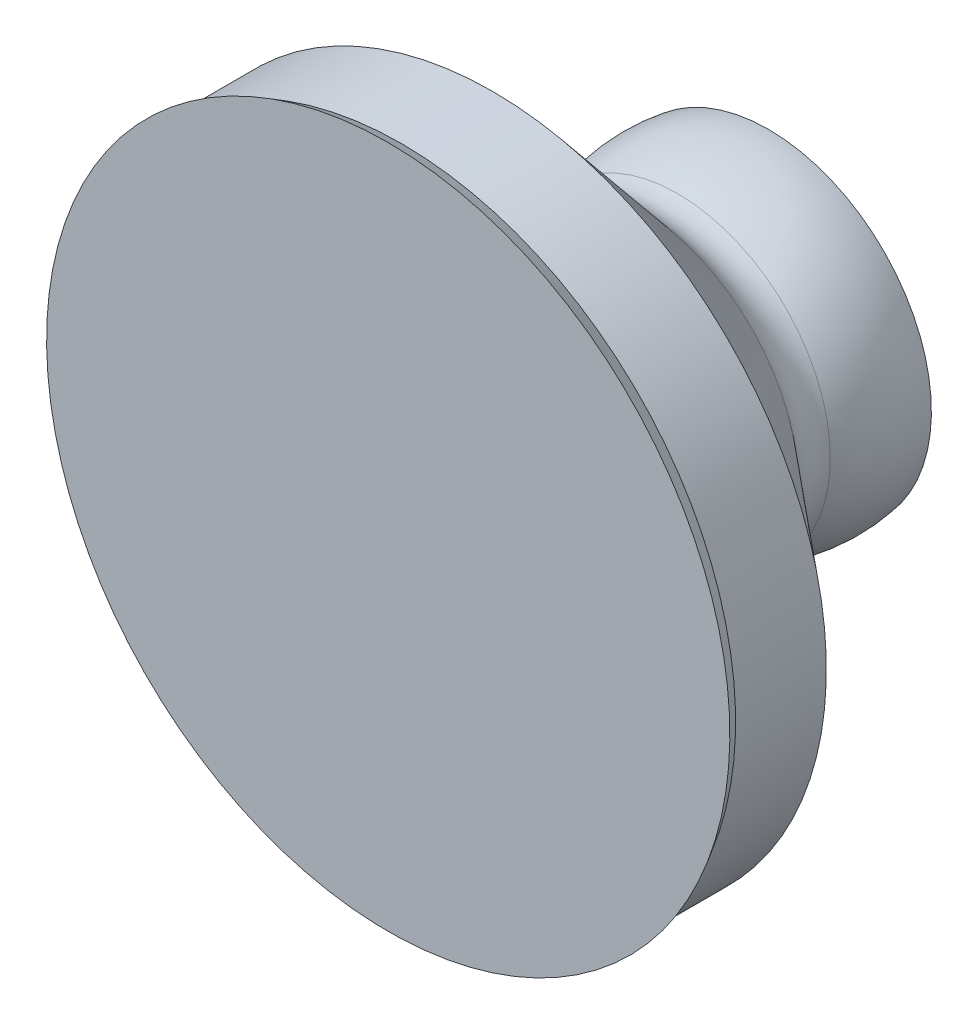
ISO-10303-21;
HEADER;
FILE_DESCRIPTION(('STEP AP214'),'2;1');
FILE_NAME('part.step','',(''),(''),'','','');
FILE_SCHEMA(('AUTOMOTIVE_DESIGN { 1 0 10303 214 1 1 1 1 }'));
ENDSEC;
DATA;
#1=APPLICATION_CONTEXT('core data for automotive mechanical design processes');
#2=APPLICATION_PROTOCOL_DEFINITION('international standard','automotive_design',2000,#1);
#3=PRODUCT_CONTEXT('',#1,'mechanical');
#4=PRODUCT('Part','Part','',(#3));
#5=PRODUCT_RELATED_PRODUCT_CATEGORY('part','',(#4));
#6=PRODUCT_DEFINITION_FORMATION('','',#4);
#7=PRODUCT_DEFINITION_CONTEXT('part definition',#1,'design');
#8=PRODUCT_DEFINITION('design','',#6,#7);
#9=PRODUCT_DEFINITION_SHAPE('','',#8);
#10=(LENGTH_UNIT() NAMED_UNIT(*) SI_UNIT(.MILLI.,.METRE.));
#11=(NAMED_UNIT(*) PLANE_ANGLE_UNIT() SI_UNIT($,.RADIAN.));
#12=(NAMED_UNIT(*) SI_UNIT($,.STERADIAN.) SOLID_ANGLE_UNIT());
#13=UNCERTAINTY_MEASURE_WITH_UNIT(LENGTH_MEASURE(1.E-05),#10,'distance_accuracy_value','');
#14=(GEOMETRIC_REPRESENTATION_CONTEXT(3) GLOBAL_UNCERTAINTY_ASSIGNED_CONTEXT((#13)) GLOBAL_UNIT_ASSIGNED_CONTEXT((#10,
#11,#12)) REPRESENTATION_CONTEXT('',''));
#15=CARTESIAN_POINT('',(0.,0.,0.));
#16=DIRECTION('',(0.,0.,1.));
#17=DIRECTION('',(1.,0.,0.));
#18=AXIS2_PLACEMENT_3D('',#15,#16,#17);
#19=CARTESIAN_POINT('',(0.,0.,0.));
#20=DIRECTION('',(0.,0.,1.));
#21=DIRECTION('',(0.,-1.,0.));
#22=AXIS2_PLACEMENT_3D('',#19,#20,#21);
#23=PLANE('',#22);
#24=CARTESIAN_POINT('',(0.,0.,0.));
#25=DIRECTION('',(0.,0.,-1.));
#26=DIRECTION('',(0.,1.,0.));
#27=AXIS2_PLACEMENT_3D('',#24,#25,#26);
#28=CIRCLE('',#27,35.8771877706717);
#29=CARTESIAN_POINT('',(0.,35.8771877706717,0.));
#30=VERTEX_POINT('',#29);
#31=EDGE_CURVE('E10',#30,#30,#28,.T.);
#32=ORIENTED_EDGE('',*,*,#31,.T.);
#33=EDGE_LOOP('',(#32));
#34=FACE_BOUND('',#33,.T.);
#35=ADVANCED_FACE('F39',(#34),#23,.F.);
#36=CARTESIAN_POINT('',(0.,0.,6.14714548940946));
#37=DIRECTION('',(0.,0.,-1.));
#38=DIRECTION('',(0.,1.,0.));
#39=AXIS2_PLACEMENT_3D('',#36,#37,#38);
#40=SPHERICAL_SURFACE('',#39,36.4);
#41=ORIENTED_EDGE('',*,*,#31,.F.);
#42=EDGE_LOOP('',(#41));
#43=FACE_BOUND('',#42,.T.);
#44=CARTESIAN_POINT('',(0.,0.,20.0426639516435));
#45=DIRECTION('',(0.,0.,-1.));
#46=DIRECTION('',(0.,1.,0.));
#47=AXIS2_PLACEMENT_3D('',#44,#45,#46);
#48=CIRCLE('',#47,33.6433435714364);
#49=CARTESIAN_POINT('',(0.,33.6433435714364,20.0426639516435));
#50=VERTEX_POINT('',#49);
#51=EDGE_CURVE('E46',#50,#50,#48,.T.);
#52=ORIENTED_EDGE('',*,*,#51,.T.);
#53=EDGE_LOOP('',(#52));
#54=FACE_BOUND('',#53,.T.);
#55=ADVANCED_FACE('F83',(#43,#54),#40,.T.);
#56=CARTESIAN_POINT('',(0.,0.,23.0966240532335));
#57=DIRECTION('',(0.,0.,-1.));
#58=DIRECTION('',(0.,1.,0.));
#59=AXIS2_PLACEMENT_3D('',#56,#57,#58);
#60=TOROIDAL_SURFACE('',#59,41.0374850157082,8.);
#61=ORIENTED_EDGE('',*,*,#51,.F.);
#62=EDGE_LOOP('',(#61));
#63=FACE_BOUND('',#62,.T.);
#64=CARTESIAN_POINT('',(0.,0.,29.2249795981853));
#65=DIRECTION('',(0.,0.,-1.));
#66=DIRECTION('',(0.,1.,0.));
#67=AXIS2_PLACEMENT_3D('',#64,#65,#66);
#68=CIRCLE('',#67,35.8951841382159);
#69=CARTESIAN_POINT('',(0.,35.8951841382159,29.2249795981853));
#70=VERTEX_POINT('',#69);
#71=EDGE_CURVE('E51',#70,#70,#68,.T.);
#72=ORIENTED_EDGE('',*,*,#71,.T.);
#73=EDGE_LOOP('',(#72));
#74=FACE_BOUND('',#73,.T.);
#75=ADVANCED_FACE('F87',(#63,#74),#60,.F.);
#76=CARTESIAN_POINT('',(0.,0.,60.8211216998566));
#77=DIRECTION('',(0.,0.,1.));
#78=DIRECTION('',(0.,-1.,0.));
#79=AXIS2_PLACEMENT_3D('',#76,#77,#78);
#80=CONICAL_SURFACE('',#79,73.55,0.872664625997167);
#81=ORIENTED_EDGE('',*,*,#71,.F.);
#82=EDGE_LOOP('',(#81));
#83=FACE_BOUND('',#82,.T.);
#84=CARTESIAN_POINT('',(0.,0.,60.8211216998566));
#85=DIRECTION('',(0.,0.,-1.));
#86=DIRECTION('',(0.,1.,0.));
#87=AXIS2_PLACEMENT_3D('',#84,#85,#86);
#88=CIRCLE('',#87,73.55);
#89=CARTESIAN_POINT('',(0.,73.55,60.8211216998566));
#90=VERTEX_POINT('',#89);
#91=EDGE_CURVE('E56',#90,#90,#88,.T.);
#92=ORIENTED_EDGE('',*,*,#91,.T.);
#93=EDGE_LOOP('',(#92));
#94=FACE_BOUND('',#93,.T.);
#95=ADVANCED_FACE('F92',(#83,#94),#80,.T.);
#96=CARTESIAN_POINT('',(0.,0.,0.));
#97=DIRECTION('',(0.,0.,-1.));
#98=DIRECTION('',(0.,1.,0.));
#99=AXIS2_PLACEMENT_3D('',#96,#97,#98);
#100=CYLINDRICAL_SURFACE('',#99,73.55);
#101=ORIENTED_EDGE('',*,*,#91,.F.);
#102=EDGE_LOOP('',(#101));
#103=FACE_BOUND('',#102,.T.);
#104=CARTESIAN_POINT('',(0.,0.,80.8211216998566));
#105=DIRECTION('',(0.,0.,-1.));
#106=DIRECTION('',(0.,1.,0.));
#107=AXIS2_PLACEMENT_3D('',#104,#105,#106);
#108=CIRCLE('',#107,73.55);
#109=CARTESIAN_POINT('',(0.,73.55,80.8211216998566));
#110=VERTEX_POINT('',#109);
#111=EDGE_CURVE('E62',#110,#110,#108,.T.);
#112=ORIENTED_EDGE('',*,*,#111,.T.);
#113=EDGE_LOOP('',(#112));
#114=FACE_BOUND('',#113,.T.);
#115=ADVANCED_FACE('F79',(#103,#114),#100,.T.);
#116=CARTESIAN_POINT('',(0.,0.,83.8211216998566));
#117=DIRECTION('',(0.,0.,1.));
#118=DIRECTION('',(0.,-1.,0.));
#119=AXIS2_PLACEMENT_3D('',#116,#117,#118);
#120=CONICAL_SURFACE('',#119,75.2820508075689,0.523598775598299);
#121=ORIENTED_EDGE('',*,*,#111,.F.);
#122=EDGE_LOOP('',(#121));
#123=FACE_BOUND('',#122,.T.);
#124=CARTESIAN_POINT('',(0.,0.,83.8211216998566));
#125=DIRECTION('',(0.,0.,-1.));
#126=DIRECTION('',(0.,1.,0.));
#127=AXIS2_PLACEMENT_3D('',#124,#125,#126);
#128=CIRCLE('',#127,75.2820508075689);
#129=CARTESIAN_POINT('',(0.,75.2820508075689,83.8211216998566));
#130=VERTEX_POINT('',#129);
#131=EDGE_CURVE('E66',#130,#130,#128,.T.);
#132=ORIENTED_EDGE('',*,*,#131,.T.);
#133=EDGE_LOOP('',(#132));
#134=FACE_BOUND('',#133,.T.);
#135=ADVANCED_FACE('F71',(#123,#134),#120,.T.);
#136=CARTESIAN_POINT('',(0.,0.,83.8211216998566));
#137=DIRECTION('',(0.,0.,-1.));
#138=DIRECTION('',(0.,1.,0.));
#139=AXIS2_PLACEMENT_3D('',#136,#137,#138);
#140=PLANE('',#139);
#141=ORIENTED_EDGE('',*,*,#131,.F.);
#142=EDGE_LOOP('',(#141));
#143=FACE_BOUND('',#142,.T.);
#144=ADVANCED_FACE('F73',(#143),#140,.F.);
#145=CLOSED_SHELL('',(#35,#55,#75,#95,#115,#135,#144));
#146=MANIFOLD_SOLID_BREP('B2',#145);
#147=ADVANCED_BREP_SHAPE_REPRESENTATION('',(#18,#146),#14);
#148=SHAPE_DEFINITION_REPRESENTATION(#9,#147);
ENDSEC;
END-ISO-10303-21;
